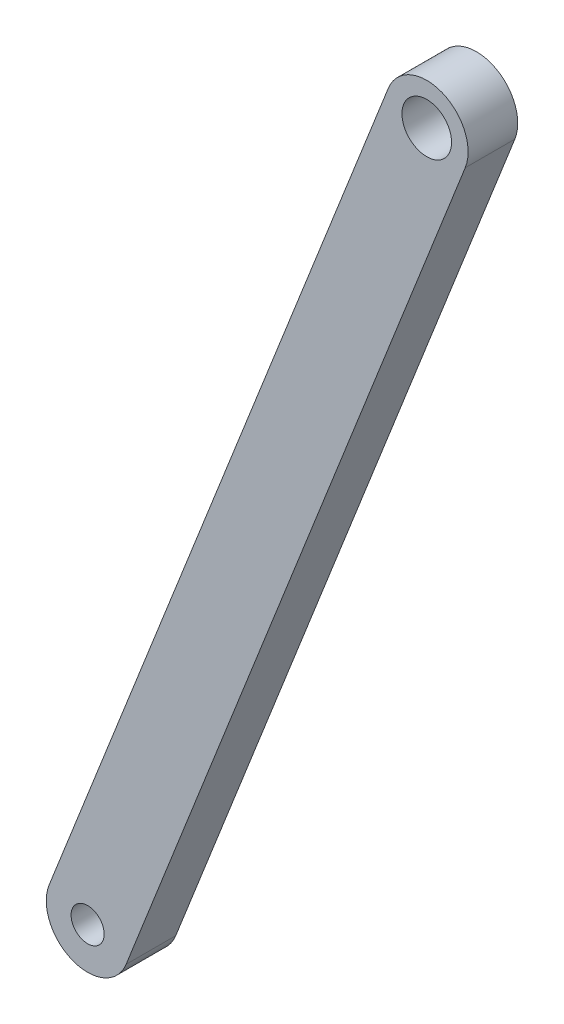
ISO-10303-21;
HEADER;
FILE_DESCRIPTION(('STEP AP214'),'2;1');
FILE_NAME('part.step','',(''),(''),'','','');
FILE_SCHEMA(('AUTOMOTIVE_DESIGN { 1 0 10303 214 1 1 1 1 }'));
ENDSEC;
DATA;
#1=APPLICATION_CONTEXT('core data for automotive mechanical design processes');
#2=APPLICATION_PROTOCOL_DEFINITION('international standard','automotive_design',2000,#1);
#3=PRODUCT_CONTEXT('',#1,'mechanical');
#4=PRODUCT('Part','Part','',(#3));
#5=PRODUCT_RELATED_PRODUCT_CATEGORY('part','',(#4));
#6=PRODUCT_DEFINITION_FORMATION('','',#4);
#7=PRODUCT_DEFINITION_CONTEXT('part definition',#1,'design');
#8=PRODUCT_DEFINITION('design','',#6,#7);
#9=PRODUCT_DEFINITION_SHAPE('','',#8);
#10=(LENGTH_UNIT() NAMED_UNIT(*) SI_UNIT(.MILLI.,.METRE.));
#11=(NAMED_UNIT(*) PLANE_ANGLE_UNIT() SI_UNIT($,.RADIAN.));
#12=(NAMED_UNIT(*) SI_UNIT($,.STERADIAN.) SOLID_ANGLE_UNIT());
#13=UNCERTAINTY_MEASURE_WITH_UNIT(LENGTH_MEASURE(1.E-05),#10,'distance_accuracy_value','');
#14=(GEOMETRIC_REPRESENTATION_CONTEXT(3) GLOBAL_UNCERTAINTY_ASSIGNED_CONTEXT((#13)) GLOBAL_UNIT_ASSIGNED_CONTEXT((#10,
#11,#12)) REPRESENTATION_CONTEXT('',''));
#15=CARTESIAN_POINT('',(0.,0.,0.));
#16=DIRECTION('',(0.,0.,1.));
#17=DIRECTION('',(1.,0.,0.));
#18=AXIS2_PLACEMENT_3D('',#15,#16,#17);
#19=CARTESIAN_POINT('',(29.,566.1,-3.));
#20=DIRECTION('',(0.,0.,1.));
#21=DIRECTION('',(1.,0.,0.));
#22=AXIS2_PLACEMENT_3D('',#19,#20,#21);
#23=CYLINDRICAL_SURFACE('',#22,4.99999999999997);
#24=DIRECTION('',(0.,0.,1.));
#25=VECTOR('',#24,1.);
#26=CARTESIAN_POINT('',(33.6509772350166,564.264676933247,-3.));
#27=LINE('',#26,#25);
#28=CARTESIAN_POINT('',(33.6509772350166,564.264676933247,-3.));
#29=VERTEX_POINT('',#28);
#30=CARTESIAN_POINT('',(33.6509772350166,564.264676933247,3.));
#31=VERTEX_POINT('',#30);
#32=EDGE_CURVE('E42',#29,#31,#27,.T.);
#33=ORIENTED_EDGE('',*,*,#32,.T.);
#34=CARTESIAN_POINT('',(29.,566.1,3.));
#35=DIRECTION('',(0.,0.,1.));
#36=DIRECTION('',(1.,0.,0.));
#37=AXIS2_PLACEMENT_3D('',#34,#35,#36);
#38=CIRCLE('',#37,4.99999999999997);
#39=CARTESIAN_POINT('',(24.3490227649834,567.935323066753,3.));
#40=VERTEX_POINT('',#39);
#41=EDGE_CURVE('E79',#40,#31,#38,.T.);
#42=ORIENTED_EDGE('',*,*,#41,.F.);
#43=DIRECTION('',(0.,0.,1.));
#44=VECTOR('',#43,1.);
#45=CARTESIAN_POINT('',(24.3490227649834,567.935323066753,-3.));
#46=LINE('',#45,#44);
#47=CARTESIAN_POINT('',(24.3490227649834,567.935323066753,-3.));
#48=VERTEX_POINT('',#47);
#49=EDGE_CURVE('E11',#48,#40,#46,.T.);
#50=ORIENTED_EDGE('',*,*,#49,.F.);
#51=CARTESIAN_POINT('',(29.,566.1,-3.));
#52=DIRECTION('',(0.,0.,1.));
#53=DIRECTION('',(1.,0.,0.));
#54=AXIS2_PLACEMENT_3D('',#51,#52,#53);
#55=CIRCLE('',#54,4.99999999999997);
#56=EDGE_CURVE('E80',#48,#29,#55,.T.);
#57=ORIENTED_EDGE('',*,*,#56,.T.);
#58=EDGE_LOOP('',(#33,#42,#50,#57));
#59=FACE_BOUND('',#58,.T.);
#60=ADVANCED_FACE('F39',(#59),#23,.T.);
#61=CARTESIAN_POINT('',(24.3490227649834,567.935323066753,-3.));
#62=DIRECTION('',(-0.930195447003323,0.367064613350685,0.));
#63=DIRECTION('',(-0.367064613350685,-0.930195447003323,0.));
#64=AXIS2_PLACEMENT_3D('',#61,#62,#63);
#65=PLANE('',#64);
#66=ORIENTED_EDGE('',*,*,#49,.T.);
#67=DIRECTION('',(-0.367064613350685,-0.930195447003323,0.));
#68=VECTOR('',#67,1.);
#69=CARTESIAN_POINT('',(24.3490227649834,567.935323066753,3.));
#70=LINE('',#69,#68);
#71=CARTESIAN_POINT('',(65.3490227649833,671.835323066754,3.));
#72=VERTEX_POINT('',#71);
#73=EDGE_CURVE('E97',#72,#40,#70,.T.);
#74=ORIENTED_EDGE('',*,*,#73,.F.);
#75=DIRECTION('',(0.,0.,1.));
#76=VECTOR('',#75,1.);
#77=CARTESIAN_POINT('',(65.3490227649833,671.835323066754,-3.));
#78=LINE('',#77,#76);
#79=CARTESIAN_POINT('',(65.3490227649833,671.835323066754,-3.));
#80=VERTEX_POINT('',#79);
#81=EDGE_CURVE('E47',#80,#72,#78,.T.);
#82=ORIENTED_EDGE('',*,*,#81,.F.);
#83=DIRECTION('',(-0.367064613350685,-0.930195447003323,0.));
#84=VECTOR('',#83,1.);
#85=CARTESIAN_POINT('',(24.3490227649834,567.935323066753,-3.));
#86=LINE('',#85,#84);
#87=EDGE_CURVE('E85',#80,#48,#86,.T.);
#88=ORIENTED_EDGE('',*,*,#87,.T.);
#89=EDGE_LOOP('',(#66,#74,#82,#88));
#90=FACE_BOUND('',#89,.T.);
#91=ADVANCED_FACE('F123',(#90),#65,.T.);
#92=CARTESIAN_POINT('',(70.,670.,-3.));
#93=DIRECTION('',(0.,0.,1.));
#94=DIRECTION('',(1.,0.,0.));
#95=AXIS2_PLACEMENT_3D('',#92,#93,#94);
#96=CYLINDRICAL_SURFACE('',#95,5.00000000000001);
#97=ORIENTED_EDGE('',*,*,#81,.T.);
#98=CARTESIAN_POINT('',(70.,670.,3.));
#99=DIRECTION('',(0.,0.,1.));
#100=DIRECTION('',(1.,0.,0.));
#101=AXIS2_PLACEMENT_3D('',#98,#99,#100);
#102=CIRCLE('',#101,5.00000000000001);
#103=CARTESIAN_POINT('',(74.6509772350167,668.164676933247,3.));
#104=VERTEX_POINT('',#103);
#105=EDGE_CURVE('E92',#104,#72,#102,.T.);
#106=ORIENTED_EDGE('',*,*,#105,.F.);
#107=DIRECTION('',(0.,0.,1.));
#108=VECTOR('',#107,1.);
#109=CARTESIAN_POINT('',(74.6509772350167,668.164676933247,-3.));
#110=LINE('',#109,#108);
#111=CARTESIAN_POINT('',(74.6509772350167,668.164676933247,-3.));
#112=VERTEX_POINT('',#111);
#113=EDGE_CURVE('E84',#112,#104,#110,.T.);
#114=ORIENTED_EDGE('',*,*,#113,.F.);
#115=CARTESIAN_POINT('',(70.,670.,-3.));
#116=DIRECTION('',(0.,0.,1.));
#117=DIRECTION('',(1.,0.,0.));
#118=AXIS2_PLACEMENT_3D('',#115,#116,#117);
#119=CIRCLE('',#118,5.00000000000001);
#120=EDGE_CURVE('E116',#112,#80,#119,.T.);
#121=ORIENTED_EDGE('',*,*,#120,.T.);
#122=EDGE_LOOP('',(#97,#106,#114,#121));
#123=FACE_BOUND('',#122,.T.);
#124=ADVANCED_FACE('F120',(#123),#96,.T.);
#125=CARTESIAN_POINT('',(33.6509772350166,564.264676933247,-3.));
#126=DIRECTION('',(0.930195447003323,-0.367064613350685,0.));
#127=DIRECTION('',(0.367064613350685,0.930195447003323,0.));
#128=AXIS2_PLACEMENT_3D('',#125,#126,#127);
#129=PLANE('',#128);
#130=ORIENTED_EDGE('',*,*,#113,.T.);
#131=DIRECTION('',(0.367064613350685,0.930195447003323,0.));
#132=VECTOR('',#131,1.);
#133=CARTESIAN_POINT('',(33.6509772350166,564.264676933247,3.));
#134=LINE('',#133,#132);
#135=EDGE_CURVE('E87',#31,#104,#134,.T.);
#136=ORIENTED_EDGE('',*,*,#135,.F.);
#137=ORIENTED_EDGE('',*,*,#32,.F.);
#138=DIRECTION('',(0.367064613350685,0.930195447003323,0.));
#139=VECTOR('',#138,1.);
#140=CARTESIAN_POINT('',(33.6509772350166,564.264676933247,-3.));
#141=LINE('',#140,#139);
#142=EDGE_CURVE('E114',#29,#112,#141,.T.);
#143=ORIENTED_EDGE('',*,*,#142,.T.);
#144=EDGE_LOOP('',(#130,#136,#137,#143));
#145=FACE_BOUND('',#144,.T.);
#146=ADVANCED_FACE('F88',(#145),#129,.T.);
#147=CARTESIAN_POINT('',(29.,566.1,-3.));
#148=DIRECTION('',(0.,0.,1.));
#149=DIRECTION('',(1.,0.,0.));
#150=AXIS2_PLACEMENT_3D('',#147,#148,#149);
#151=PLANE('',#150);
#152=CARTESIAN_POINT('',(29.,566.1,-3.));
#153=DIRECTION('',(0.,0.,1.));
#154=DIRECTION('',(1.,0.,0.));
#155=AXIS2_PLACEMENT_3D('',#152,#153,#154);
#156=CIRCLE('',#155,2.00000000000001);
#157=CARTESIAN_POINT('',(31.,566.1,-3.));
#158=VERTEX_POINT('',#157);
#159=EDGE_CURVE('E107',#158,#158,#156,.T.);
#160=ORIENTED_EDGE('',*,*,#159,.T.);
#161=EDGE_LOOP('',(#160));
#162=FACE_BOUND('',#161,.T.);
#163=CARTESIAN_POINT('',(70.,670.,-3.));
#164=DIRECTION('',(0.,0.,1.));
#165=DIRECTION('',(1.,0.,0.));
#166=AXIS2_PLACEMENT_3D('',#163,#164,#165);
#167=CIRCLE('',#166,3.00000000000001);
#168=CARTESIAN_POINT('',(73.,670.,-3.));
#169=VERTEX_POINT('',#168);
#170=EDGE_CURVE('E110',#169,#169,#167,.T.);
#171=ORIENTED_EDGE('',*,*,#170,.T.);
#172=EDGE_LOOP('',(#171));
#173=FACE_BOUND('',#172,.T.);
#174=ORIENTED_EDGE('',*,*,#56,.F.);
#175=ORIENTED_EDGE('',*,*,#87,.F.);
#176=ORIENTED_EDGE('',*,*,#120,.F.);
#177=ORIENTED_EDGE('',*,*,#142,.F.);
#178=EDGE_LOOP('',(#174,#175,#176,#177));
#179=FACE_BOUND('',#178,.T.);
#180=ADVANCED_FACE('F125',(#162,#173,#179),#151,.F.);
#181=CARTESIAN_POINT('',(70.,670.,-3.));
#182=DIRECTION('',(0.,0.,1.));
#183=DIRECTION('',(1.,0.,0.));
#184=AXIS2_PLACEMENT_3D('',#181,#182,#183);
#185=CYLINDRICAL_SURFACE('',#184,3.00000000000001);
#186=ORIENTED_EDGE('',*,*,#170,.F.);
#187=EDGE_LOOP('',(#186));
#188=FACE_BOUND('',#187,.T.);
#189=CARTESIAN_POINT('',(70.,670.,3.));
#190=DIRECTION('',(0.,0.,1.));
#191=DIRECTION('',(1.,0.,0.));
#192=AXIS2_PLACEMENT_3D('',#189,#190,#191);
#193=CIRCLE('',#192,3.00000000000001);
#194=CARTESIAN_POINT('',(73.,670.,3.));
#195=VERTEX_POINT('',#194);
#196=EDGE_CURVE('E98',#195,#195,#193,.T.);
#197=ORIENTED_EDGE('',*,*,#196,.T.);
#198=EDGE_LOOP('',(#197));
#199=FACE_BOUND('',#198,.T.);
#200=ADVANCED_FACE('F127',(#188,#199),#185,.F.);
#201=CARTESIAN_POINT('',(29.,566.1,-3.));
#202=DIRECTION('',(0.,0.,1.));
#203=DIRECTION('',(1.,0.,0.));
#204=AXIS2_PLACEMENT_3D('',#201,#202,#203);
#205=CYLINDRICAL_SURFACE('',#204,2.00000000000001);
#206=ORIENTED_EDGE('',*,*,#159,.F.);
#207=EDGE_LOOP('',(#206));
#208=FACE_BOUND('',#207,.T.);
#209=CARTESIAN_POINT('',(29.,566.1,3.));
#210=DIRECTION('',(0.,0.,1.));
#211=DIRECTION('',(1.,0.,0.));
#212=AXIS2_PLACEMENT_3D('',#209,#210,#211);
#213=CIRCLE('',#212,2.00000000000001);
#214=CARTESIAN_POINT('',(31.,566.1,3.));
#215=VERTEX_POINT('',#214);
#216=EDGE_CURVE('E101',#215,#215,#213,.T.);
#217=ORIENTED_EDGE('',*,*,#216,.T.);
#218=EDGE_LOOP('',(#217));
#219=FACE_BOUND('',#218,.T.);
#220=ADVANCED_FACE('F134',(#208,#219),#205,.F.);
#221=CARTESIAN_POINT('',(29.,566.1,3.));
#222=DIRECTION('',(0.,0.,1.));
#223=DIRECTION('',(1.,0.,0.));
#224=AXIS2_PLACEMENT_3D('',#221,#222,#223);
#225=PLANE('',#224);
#226=ORIENTED_EDGE('',*,*,#196,.F.);
#227=EDGE_LOOP('',(#226));
#228=FACE_BOUND('',#227,.T.);
#229=ORIENTED_EDGE('',*,*,#41,.T.);
#230=ORIENTED_EDGE('',*,*,#135,.T.);
#231=ORIENTED_EDGE('',*,*,#105,.T.);
#232=ORIENTED_EDGE('',*,*,#73,.T.);
#233=EDGE_LOOP('',(#229,#230,#231,#232));
#234=FACE_BOUND('',#233,.T.);
#235=ORIENTED_EDGE('',*,*,#216,.F.);
#236=EDGE_LOOP('',(#235));
#237=FACE_BOUND('',#236,.T.);
#238=ADVANCED_FACE('F95',(#228,#234,#237),#225,.T.);
#239=CLOSED_SHELL('',(#60,#91,#124,#146,#180,#200,#220,#238));
#240=MANIFOLD_SOLID_BREP('B2',#239);
#241=ADVANCED_BREP_SHAPE_REPRESENTATION('',(#18,#240),#14);
#242=SHAPE_DEFINITION_REPRESENTATION(#9,#241);
ENDSEC;
END-ISO-10303-21;
